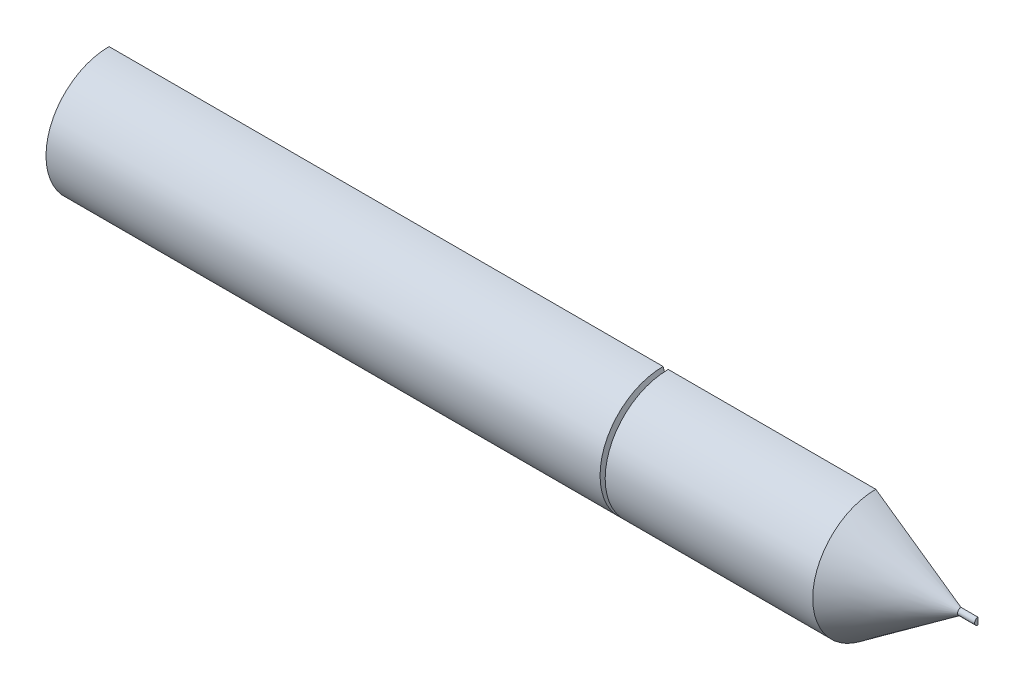
ISO-10303-21;
HEADER;
FILE_DESCRIPTION(('STEP AP214'),'2;1');
FILE_NAME('part.step','',(''),(''),'','','');
FILE_SCHEMA(('AUTOMOTIVE_DESIGN { 1 0 10303 214 1 1 1 1 }'));
ENDSEC;
DATA;
#1=APPLICATION_CONTEXT('core data for automotive mechanical design processes');
#2=APPLICATION_PROTOCOL_DEFINITION('international standard','automotive_design',2000,#1);
#3=PRODUCT_CONTEXT('',#1,'mechanical');
#4=PRODUCT('Part','Part','',(#3));
#5=PRODUCT_RELATED_PRODUCT_CATEGORY('part','',(#4));
#6=PRODUCT_DEFINITION_FORMATION('','',#4);
#7=PRODUCT_DEFINITION_CONTEXT('part definition',#1,'design');
#8=PRODUCT_DEFINITION('design','',#6,#7);
#9=PRODUCT_DEFINITION_SHAPE('','',#8);
#10=(LENGTH_UNIT() NAMED_UNIT(*) SI_UNIT(.MILLI.,.METRE.));
#11=(NAMED_UNIT(*) PLANE_ANGLE_UNIT() SI_UNIT($,.RADIAN.));
#12=(NAMED_UNIT(*) SI_UNIT($,.STERADIAN.) SOLID_ANGLE_UNIT());
#13=UNCERTAINTY_MEASURE_WITH_UNIT(LENGTH_MEASURE(1.E-05),#10,'distance_accuracy_value','');
#14=(GEOMETRIC_REPRESENTATION_CONTEXT(3) GLOBAL_UNCERTAINTY_ASSIGNED_CONTEXT((#13)) GLOBAL_UNIT_ASSIGNED_CONTEXT((#10,
#11,#12)) REPRESENTATION_CONTEXT('',''));
#15=CARTESIAN_POINT('',(0.,0.,0.));
#16=DIRECTION('',(0.,0.,1.));
#17=DIRECTION('',(1.,0.,0.));
#18=AXIS2_PLACEMENT_3D('',#15,#16,#17);
#19=CARTESIAN_POINT('',(-125.,0.,0.));
#20=DIRECTION('',(-1.,0.,0.));
#21=DIRECTION('',(0.,-1.,0.));
#22=AXIS2_PLACEMENT_3D('',#19,#20,#21);
#23=CYLINDRICAL_SURFACE('',#22,37.);
#24=DIRECTION('',(-1.,0.,0.));
#25=VECTOR('',#24,1.);
#26=CARTESIAN_POINT('',(-125.,-37.,0.));
#27=LINE('',#26,#25);
#28=CARTESIAN_POINT('',(135.,-37.,0.));
#29=VERTEX_POINT('',#28);
#30=CARTESIAN_POINT('',(13.1728036748125,-37.,0.));
#31=VERTEX_POINT('',#30);
#32=EDGE_CURVE('E258',#29,#31,#27,.T.);
#33=ORIENTED_EDGE('',*,*,#32,.F.);
#34=CARTESIAN_POINT('',(135.,0.,0.));
#35=DIRECTION('',(-1.,0.,0.));
#36=DIRECTION('',(0.,-1.,0.));
#37=AXIS2_PLACEMENT_3D('',#34,#35,#36);
#38=CIRCLE('',#37,37.);
#39=CARTESIAN_POINT('',(135.,37.,0.));
#40=VERTEX_POINT('',#39);
#41=EDGE_CURVE('E180',#29,#40,#38,.T.);
#42=ORIENTED_EDGE('',*,*,#41,.T.);
#43=DIRECTION('',(-1.,0.,0.));
#44=VECTOR('',#43,1.);
#45=CARTESIAN_POINT('',(-125.,37.,0.));
#46=LINE('',#45,#44);
#47=CARTESIAN_POINT('',(13.1728036748125,37.,0.));
#48=VERTEX_POINT('',#47);
#49=EDGE_CURVE('E233',#48,#40,#46,.F.);
#50=ORIENTED_EDGE('',*,*,#49,.F.);
#51=CARTESIAN_POINT('',(13.1728036748125,0.,0.));
#52=DIRECTION('',(-1.,0.,0.));
#53=DIRECTION('',(0.,0.,1.));
#54=AXIS2_PLACEMENT_3D('',#51,#52,#53);
#55=CIRCLE('',#54,36.9999999999999);
#56=EDGE_CURVE('E158',#31,#48,#55,.T.);
#57=ORIENTED_EDGE('',*,*,#56,.F.);
#58=EDGE_LOOP('',(#33,#42,#50,#57));
#59=FACE_BOUND('',#58,.T.);
#60=ADVANCED_FACE('F48',(#59),#23,.T.);
#61=CARTESIAN_POINT('',(194.985180235974,2.,0.));
#62=DIRECTION('',(-1.,0.,0.));
#63=DIRECTION('',(0.,-1.,0.));
#64=AXIS2_PLACEMENT_3D('',#61,#62,#63);
#65=PLANE('',#64);
#66=DIRECTION('',(0.,-1.,0.));
#67=VECTOR('',#66,1.);
#68=CARTESIAN_POINT('',(194.985180235974,2.,0.));
#69=LINE('',#68,#67);
#70=CARTESIAN_POINT('',(194.985180235974,2.,0.));
#71=VERTEX_POINT('',#70);
#72=CARTESIAN_POINT('',(194.985180235974,-2.,0.));
#73=VERTEX_POINT('',#72);
#74=EDGE_CURVE('E246',#71,#73,#69,.T.);
#75=ORIENTED_EDGE('',*,*,#74,.F.);
#76=CARTESIAN_POINT('',(194.985180235974,0.,0.));
#77=DIRECTION('',(-1.,0.,0.));
#78=DIRECTION('',(0.,-1.,0.));
#79=AXIS2_PLACEMENT_3D('',#76,#77,#78);
#80=CIRCLE('',#79,2.);
#81=EDGE_CURVE('E172',#73,#71,#80,.T.);
#82=ORIENTED_EDGE('',*,*,#81,.F.);
#83=EDGE_LOOP('',(#75,#82));
#84=FACE_BOUND('',#83,.T.);
#85=ADVANCED_FACE('F50',(#84),#65,.F.);
#86=CARTESIAN_POINT('',(184.985180235974,0.,0.));
#87=DIRECTION('',(-1.,0.,0.));
#88=DIRECTION('',(0.,-1.,0.));
#89=AXIS2_PLACEMENT_3D('',#86,#87,#88);
#90=CONICAL_SURFACE('',#89,2.,0.610865238198017);
#91=DIRECTION('',(-0.819152044288991,-0.573576436351047,0.));
#92=VECTOR('',#91,1.);
#93=CARTESIAN_POINT('',(187.841476249458,0.,0.));
#94=LINE('',#93,#92);
#95=CARTESIAN_POINT('',(184.985180235974,-2.,0.));
#96=VERTEX_POINT('',#95);
#97=EDGE_CURVE('E71',#96,#29,#94,.T.);
#98=ORIENTED_EDGE('',*,*,#97,.F.);
#99=CARTESIAN_POINT('',(184.985180235974,0.,0.));
#100=DIRECTION('',(-1.,0.,0.));
#101=DIRECTION('',(0.,-1.,0.));
#102=AXIS2_PLACEMENT_3D('',#99,#100,#101);
#103=CIRCLE('',#102,2.);
#104=CARTESIAN_POINT('',(184.985180235974,2.,0.));
#105=VERTEX_POINT('',#104);
#106=EDGE_CURVE('E176',#96,#105,#103,.T.);
#107=ORIENTED_EDGE('',*,*,#106,.T.);
#108=DIRECTION('',(0.819152044288991,-0.573576436351047,0.));
#109=VECTOR('',#108,1.);
#110=CARTESIAN_POINT('',(187.841476249458,0.,0.));
#111=LINE('',#110,#109);
#112=EDGE_CURVE('E236',#40,#105,#111,.T.);
#113=ORIENTED_EDGE('',*,*,#112,.F.);
#114=ORIENTED_EDGE('',*,*,#41,.F.);
#115=EDGE_LOOP('',(#98,#107,#113,#114));
#116=FACE_BOUND('',#115,.T.);
#117=ADVANCED_FACE('F283',(#116),#90,.T.);
#118=CARTESIAN_POINT('',(-125.,0.,0.));
#119=DIRECTION('',(-1.,0.,0.));
#120=DIRECTION('',(0.,-1.,0.));
#121=AXIS2_PLACEMENT_3D('',#118,#119,#120);
#122=CYLINDRICAL_SURFACE('',#121,2.);
#123=DIRECTION('',(-1.,0.,0.));
#124=VECTOR('',#123,1.);
#125=CARTESIAN_POINT('',(-125.,-1.99999999999999,0.));
#126=LINE('',#125,#124);
#127=EDGE_CURVE('E253',#73,#96,#126,.T.);
#128=ORIENTED_EDGE('',*,*,#127,.F.);
#129=ORIENTED_EDGE('',*,*,#81,.T.);
#130=DIRECTION('',(-1.,0.,0.));
#131=VECTOR('',#130,1.);
#132=CARTESIAN_POINT('',(-125.,2.00000000000001,0.));
#133=LINE('',#132,#131);
#134=EDGE_CURVE('E243',#105,#71,#133,.F.);
#135=ORIENTED_EDGE('',*,*,#134,.F.);
#136=ORIENTED_EDGE('',*,*,#106,.F.);
#137=EDGE_LOOP('',(#128,#129,#135,#136));
#138=FACE_BOUND('',#137,.T.);
#139=ADVANCED_FACE('F287',(#138),#122,.T.);
#140=CARTESIAN_POINT('',(23.,0.,0.));
#141=DIRECTION('',(-1.,0.,0.));
#142=DIRECTION('',(0.,0.,1.));
#143=AXIS2_PLACEMENT_3D('',#140,#141,#142);
#144=PLANE('',#143);
#145=CARTESIAN_POINT('',(23.,0.,0.));
#146=DIRECTION('',(-1.,0.,0.));
#147=DIRECTION('',(0.,0.,1.));
#148=AXIS2_PLACEMENT_3D('',#145,#146,#147);
#149=CIRCLE('',#148,10.);
#150=CARTESIAN_POINT('',(23.,-10.,0.));
#151=VERTEX_POINT('',#150);
#152=CARTESIAN_POINT('',(23.,10.,0.));
#153=VERTEX_POINT('',#152);
#154=EDGE_CURVE('E163',#151,#153,#149,.T.);
#155=ORIENTED_EDGE('',*,*,#154,.T.);
#156=DIRECTION('',(0.,-1.,0.));
#157=VECTOR('',#156,1.);
#158=CARTESIAN_POINT('',(23.,0.,0.));
#159=LINE('',#158,#157);
#160=CARTESIAN_POINT('',(23.,0.5,0.));
#161=VERTEX_POINT('',#160);
#162=EDGE_CURVE('E221',#153,#161,#159,.T.);
#163=ORIENTED_EDGE('',*,*,#162,.T.);
#164=CARTESIAN_POINT('',(23.,0.,0.));
#165=DIRECTION('',(-1.,0.,0.));
#166=DIRECTION('',(0.,0.,1.));
#167=AXIS2_PLACEMENT_3D('',#164,#165,#166);
#168=CIRCLE('',#167,0.5);
#169=CARTESIAN_POINT('',(23.,-0.5,0.));
#170=VERTEX_POINT('',#169);
#171=EDGE_CURVE('E165',#170,#161,#168,.T.);
#172=ORIENTED_EDGE('',*,*,#171,.F.);
#173=EDGE_CURVE('E226',#170,#151,#159,.T.);
#174=ORIENTED_EDGE('',*,*,#173,.T.);
#175=EDGE_LOOP('',(#155,#163,#172,#174));
#176=FACE_BOUND('',#175,.T.);
#177=ADVANCED_FACE('F272',(#176),#144,.T.);
#178=CARTESIAN_POINT('',(23.,0.,0.));
#179=DIRECTION('',(-1.,0.,0.));
#180=DIRECTION('',(0.,0.,1.));
#181=AXIS2_PLACEMENT_3D('',#178,#179,#180);
#182=CONICAL_SURFACE('',#181,10.,1.22173047639603);
#183=ORIENTED_EDGE('',*,*,#154,.F.);
#184=DIRECTION('',(-0.34202014332567,-0.939692620785908,0.));
#185=VECTOR('',#184,1.);
#186=CARTESIAN_POINT('',(26.639702342662,0.,0.));
#187=LINE('',#186,#185);
#188=EDGE_CURVE('E249',#151,#31,#187,.T.);
#189=ORIENTED_EDGE('',*,*,#188,.T.);
#190=ORIENTED_EDGE('',*,*,#56,.T.);
#191=DIRECTION('',(0.34202014332567,-0.939692620785908,0.));
#192=VECTOR('',#191,1.);
#193=CARTESIAN_POINT('',(26.639702342662,0.,0.));
#194=LINE('',#193,#192);
#195=EDGE_CURVE('E229',#48,#153,#194,.T.);
#196=ORIENTED_EDGE('',*,*,#195,.T.);
#197=EDGE_LOOP('',(#183,#189,#190,#196));
#198=FACE_BOUND('',#197,.T.);
#199=ADVANCED_FACE('F276',(#198),#182,.F.);
#200=CARTESIAN_POINT('',(10.1728036748125,0.,0.));
#201=DIRECTION('',(-1.,0.,0.));
#202=DIRECTION('',(0.,0.,1.));
#203=AXIS2_PLACEMENT_3D('',#200,#201,#202);
#204=CONICAL_SURFACE('',#203,36.9999999999999,1.22173047639603);
#205=CARTESIAN_POINT('',(10.1728036748125,0.,0.));
#206=DIRECTION('',(-1.,0.,0.));
#207=DIRECTION('',(0.,0.,1.));
#208=AXIS2_PLACEMENT_3D('',#205,#206,#207);
#209=CIRCLE('',#208,36.9999999999999);
#210=CARTESIAN_POINT('',(10.1728036748125,-37.,0.));
#211=VERTEX_POINT('',#210);
#212=CARTESIAN_POINT('',(10.1728036748125,37.,0.));
#213=VERTEX_POINT('',#212);
#214=EDGE_CURVE('E148',#211,#213,#209,.T.);
#215=ORIENTED_EDGE('',*,*,#214,.F.);
#216=DIRECTION('',(-0.34202014332567,-0.939692620785908,0.));
#217=VECTOR('',#216,1.);
#218=CARTESIAN_POINT('',(23.639702342662,0.,0.));
#219=LINE('',#218,#217);
#220=CARTESIAN_POINT('',(20.,-10.,0.));
#221=VERTEX_POINT('',#220);
#222=EDGE_CURVE('E225',#211,#221,#219,.F.);
#223=ORIENTED_EDGE('',*,*,#222,.T.);
#224=CARTESIAN_POINT('',(20.,0.,0.));
#225=DIRECTION('',(-1.,0.,0.));
#226=DIRECTION('',(0.,0.,1.));
#227=AXIS2_PLACEMENT_3D('',#224,#225,#226);
#228=CIRCLE('',#227,10.);
#229=CARTESIAN_POINT('',(20.,10.,0.));
#230=VERTEX_POINT('',#229);
#231=EDGE_CURVE('E150',#221,#230,#228,.T.);
#232=ORIENTED_EDGE('',*,*,#231,.T.);
#233=DIRECTION('',(0.34202014332567,-0.939692620785908,0.));
#234=VECTOR('',#233,1.);
#235=CARTESIAN_POINT('',(23.639702342662,0.,0.));
#236=LINE('',#235,#234);
#237=EDGE_CURVE('E135',#230,#213,#236,.F.);
#238=ORIENTED_EDGE('',*,*,#237,.T.);
#239=EDGE_LOOP('',(#215,#223,#232,#238));
#240=FACE_BOUND('',#239,.T.);
#241=ADVANCED_FACE('F146',(#240),#204,.T.);
#242=CARTESIAN_POINT('',(20.,0.,0.));
#243=DIRECTION('',(1.,0.,0.));
#244=DIRECTION('',(0.,0.,-1.));
#245=AXIS2_PLACEMENT_3D('',#242,#243,#244);
#246=PLANE('',#245);
#247=ORIENTED_EDGE('',*,*,#231,.F.);
#248=DIRECTION('',(0.,1.,0.));
#249=VECTOR('',#248,1.);
#250=CARTESIAN_POINT('',(20.,0.,0.));
#251=LINE('',#250,#249);
#252=CARTESIAN_POINT('',(20.,-0.5,0.));
#253=VERTEX_POINT('',#252);
#254=EDGE_CURVE('E216',#221,#253,#251,.T.);
#255=ORIENTED_EDGE('',*,*,#254,.T.);
#256=CARTESIAN_POINT('',(20.,0.,0.));
#257=DIRECTION('',(-1.,0.,0.));
#258=DIRECTION('',(0.,0.,1.));
#259=AXIS2_PLACEMENT_3D('',#256,#257,#258);
#260=CIRCLE('',#259,0.5);
#261=CARTESIAN_POINT('',(20.,0.5,0.));
#262=VERTEX_POINT('',#261);
#263=EDGE_CURVE('E261',#253,#262,#260,.T.);
#264=ORIENTED_EDGE('',*,*,#263,.T.);
#265=EDGE_CURVE('E213',#262,#230,#251,.T.);
#266=ORIENTED_EDGE('',*,*,#265,.T.);
#267=EDGE_LOOP('',(#247,#255,#264,#266));
#268=FACE_BOUND('',#267,.T.);
#269=ADVANCED_FACE('F318',(#268),#246,.T.);
#270=CARTESIAN_POINT('',(30.,0.,0.));
#271=DIRECTION('',(-1.,0.,0.));
#272=DIRECTION('',(0.,0.,1.));
#273=AXIS2_PLACEMENT_3D('',#270,#271,#272);
#274=CYLINDRICAL_SURFACE('',#273,0.5);
#275=ORIENTED_EDGE('',*,*,#263,.F.);
#276=DIRECTION('',(-1.,0.,0.));
#277=VECTOR('',#276,1.);
#278=CARTESIAN_POINT('',(30.,-0.5,0.));
#279=LINE('',#278,#277);
#280=EDGE_CURVE('E239',#253,#170,#279,.F.);
#281=ORIENTED_EDGE('',*,*,#280,.T.);
#282=ORIENTED_EDGE('',*,*,#171,.T.);
#283=DIRECTION('',(-1.,0.,0.));
#284=VECTOR('',#283,1.);
#285=CARTESIAN_POINT('',(30.,0.5,0.));
#286=LINE('',#285,#284);
#287=EDGE_CURVE('E217',#161,#262,#286,.T.);
#288=ORIENTED_EDGE('',*,*,#287,.T.);
#289=EDGE_LOOP('',(#275,#281,#282,#288));
#290=FACE_BOUND('',#289,.T.);
#291=ADVANCED_FACE('F269',(#290),#274,.T.);
#292=CARTESIAN_POINT('',(-325.,0.,0.));
#293=DIRECTION('',(1.,0.,0.));
#294=DIRECTION('',(0.,1.,0.));
#295=AXIS2_PLACEMENT_3D('',#292,#293,#294);
#296=PLANE('',#295);
#297=DIRECTION('',(0.,1.,0.));
#298=VECTOR('',#297,1.);
#299=CARTESIAN_POINT('',(-325.,0.,0.));
#300=LINE('',#299,#298);
#301=CARTESIAN_POINT('',(-325.,-1.99999999999995,0.));
#302=VERTEX_POINT('',#301);
#303=CARTESIAN_POINT('',(-325.,1.99999999999998,0.));
#304=VERTEX_POINT('',#303);
#305=EDGE_CURVE('E153',#302,#304,#300,.T.);
#306=ORIENTED_EDGE('',*,*,#305,.F.);
#307=CARTESIAN_POINT('',(-325.,0.,0.));
#308=DIRECTION('',(-1.,0.,0.));
#309=DIRECTION('',(0.,-1.,0.));
#310=AXIS2_PLACEMENT_3D('',#307,#308,#309);
#311=CIRCLE('',#310,1.99999999999997);
#312=EDGE_CURVE('E142',#302,#304,#311,.T.);
#313=ORIENTED_EDGE('',*,*,#312,.T.);
#314=EDGE_LOOP('',(#306,#313));
#315=FACE_BOUND('',#314,.T.);
#316=ADVANCED_FACE('F196',(#315),#296,.F.);
#317=CARTESIAN_POINT('',(-125.,0.,0.));
#318=DIRECTION('',(-1.,0.,0.));
#319=DIRECTION('',(0.,-1.,0.));
#320=AXIS2_PLACEMENT_3D('',#317,#318,#319);
#321=CYLINDRICAL_SURFACE('',#320,1.99999999999996);
#322=DIRECTION('',(-1.,0.,0.));
#323=VECTOR('',#322,1.);
#324=CARTESIAN_POINT('',(-125.,-1.99999999999995,0.));
#325=LINE('',#324,#323);
#326=CARTESIAN_POINT('',(-315.,-1.99999999999994,0.));
#327=VERTEX_POINT('',#326);
#328=EDGE_CURVE('E152',#327,#302,#325,.T.);
#329=ORIENTED_EDGE('',*,*,#328,.F.);
#330=CARTESIAN_POINT('',(-315.,0.,0.));
#331=DIRECTION('',(-1.,0.,0.));
#332=DIRECTION('',(0.,-1.,0.));
#333=AXIS2_PLACEMENT_3D('',#330,#331,#332);
#334=CIRCLE('',#333,1.99999999999996);
#335=CARTESIAN_POINT('',(-315.,1.99999999999998,0.));
#336=VERTEX_POINT('',#335);
#337=EDGE_CURVE('E187',#327,#336,#334,.T.);
#338=ORIENTED_EDGE('',*,*,#337,.T.);
#339=DIRECTION('',(-1.,0.,0.));
#340=VECTOR('',#339,1.);
#341=CARTESIAN_POINT('',(-125.,1.99999999999997,0.));
#342=LINE('',#341,#340);
#343=EDGE_CURVE('E202',#304,#336,#342,.F.);
#344=ORIENTED_EDGE('',*,*,#343,.F.);
#345=ORIENTED_EDGE('',*,*,#312,.F.);
#346=EDGE_LOOP('',(#329,#338,#344,#345));
#347=FACE_BOUND('',#346,.T.);
#348=ADVANCED_FACE('F200',(#347),#321,.T.);
#349=CARTESIAN_POINT('',(-315.,1.99999999999998,0.));
#350=DIRECTION('',(1.,0.,0.));
#351=DIRECTION('',(0.,1.,0.));
#352=AXIS2_PLACEMENT_3D('',#349,#350,#351);
#353=PLANE('',#352);
#354=DIRECTION('',(0.,1.,0.));
#355=VECTOR('',#354,1.);
#356=CARTESIAN_POINT('',(-315.,1.99999999999998,0.));
#357=LINE('',#356,#355);
#358=CARTESIAN_POINT('',(-315.,-36.9999999999999,0.));
#359=VERTEX_POINT('',#358);
#360=EDGE_CURVE('E209',#359,#327,#357,.T.);
#361=ORIENTED_EDGE('',*,*,#360,.F.);
#362=CARTESIAN_POINT('',(-315.,0.,0.));
#363=DIRECTION('',(-1.,0.,0.));
#364=DIRECTION('',(0.,-1.,0.));
#365=AXIS2_PLACEMENT_3D('',#362,#363,#364);
#366=CIRCLE('',#365,37.);
#367=CARTESIAN_POINT('',(-315.,37.,0.));
#368=VERTEX_POINT('',#367);
#369=EDGE_CURVE('E184',#359,#368,#366,.T.);
#370=ORIENTED_EDGE('',*,*,#369,.T.);
#371=EDGE_CURVE('E64',#336,#368,#357,.T.);
#372=ORIENTED_EDGE('',*,*,#371,.F.);
#373=ORIENTED_EDGE('',*,*,#337,.F.);
#374=EDGE_LOOP('',(#361,#370,#372,#373));
#375=FACE_BOUND('',#374,.T.);
#376=ADVANCED_FACE('F302',(#375),#353,.F.);
#377=DIRECTION('',(-1.,0.,0.));
#378=VECTOR('',#377,1.);
#379=CARTESIAN_POINT('',(-125.,-37.,0.));
#380=LINE('',#379,#378);
#381=EDGE_CURVE('E11',#211,#359,#380,.T.);
#382=ORIENTED_EDGE('',*,*,#381,.F.);
#383=ORIENTED_EDGE('',*,*,#214,.T.);
#384=DIRECTION('',(-1.,0.,0.));
#385=VECTOR('',#384,1.);
#386=CARTESIAN_POINT('',(-125.,37.,0.));
#387=LINE('',#386,#385);
#388=EDGE_CURVE('E57',#368,#213,#387,.F.);
#389=ORIENTED_EDGE('',*,*,#388,.F.);
#390=ORIENTED_EDGE('',*,*,#369,.F.);
#391=EDGE_LOOP('',(#382,#383,#389,#390));
#392=FACE_BOUND('',#391,.T.);
#393=ADVANCED_FACE('F156',(#392),#23,.T.);
#394=CARTESIAN_POINT('',(0.,0.,0.));
#395=DIRECTION('',(0.,0.,-1.));
#396=DIRECTION('',(-1.,0.,0.));
#397=AXIS2_PLACEMENT_3D('',#394,#395,#396);
#398=PLANE('',#397);
#399=ORIENTED_EDGE('',*,*,#32,.T.);
#400=ORIENTED_EDGE('',*,*,#188,.F.);
#401=ORIENTED_EDGE('',*,*,#173,.F.);
#402=ORIENTED_EDGE('',*,*,#280,.F.);
#403=ORIENTED_EDGE('',*,*,#254,.F.);
#404=ORIENTED_EDGE('',*,*,#222,.F.);
#405=ORIENTED_EDGE('',*,*,#381,.T.);
#406=ORIENTED_EDGE('',*,*,#360,.T.);
#407=ORIENTED_EDGE('',*,*,#328,.T.);
#408=ORIENTED_EDGE('',*,*,#305,.T.);
#409=ORIENTED_EDGE('',*,*,#343,.T.);
#410=ORIENTED_EDGE('',*,*,#371,.T.);
#411=ORIENTED_EDGE('',*,*,#388,.T.);
#412=ORIENTED_EDGE('',*,*,#237,.F.);
#413=ORIENTED_EDGE('',*,*,#265,.F.);
#414=ORIENTED_EDGE('',*,*,#287,.F.);
#415=ORIENTED_EDGE('',*,*,#162,.F.);
#416=ORIENTED_EDGE('',*,*,#195,.F.);
#417=ORIENTED_EDGE('',*,*,#49,.T.);
#418=ORIENTED_EDGE('',*,*,#112,.T.);
#419=ORIENTED_EDGE('',*,*,#134,.T.);
#420=ORIENTED_EDGE('',*,*,#74,.T.);
#421=ORIENTED_EDGE('',*,*,#127,.T.);
#422=ORIENTED_EDGE('',*,*,#97,.T.);
#423=EDGE_LOOP('',(#399,#400,#401,#402,#403,#404,#405,#406,#407,#408,#409,#410,#411,#412,#413,
#414,#415,#416,#417,#418,#419,#420,#421,#422));
#424=FACE_BOUND('',#423,.T.);
#425=ADVANCED_FACE('F134',(#424),#398,.T.);
#426=CLOSED_SHELL('',(#60,#85,#117,#139,#177,#199,#241,#269,#291,#316,#348,#376,#393,#425));
#427=MANIFOLD_SOLID_BREP('B2',#426);
#428=ADVANCED_BREP_SHAPE_REPRESENTATION('',(#18,#427),#14);
#429=SHAPE_DEFINITION_REPRESENTATION(#9,#428);
ENDSEC;
END-ISO-10303-21;
